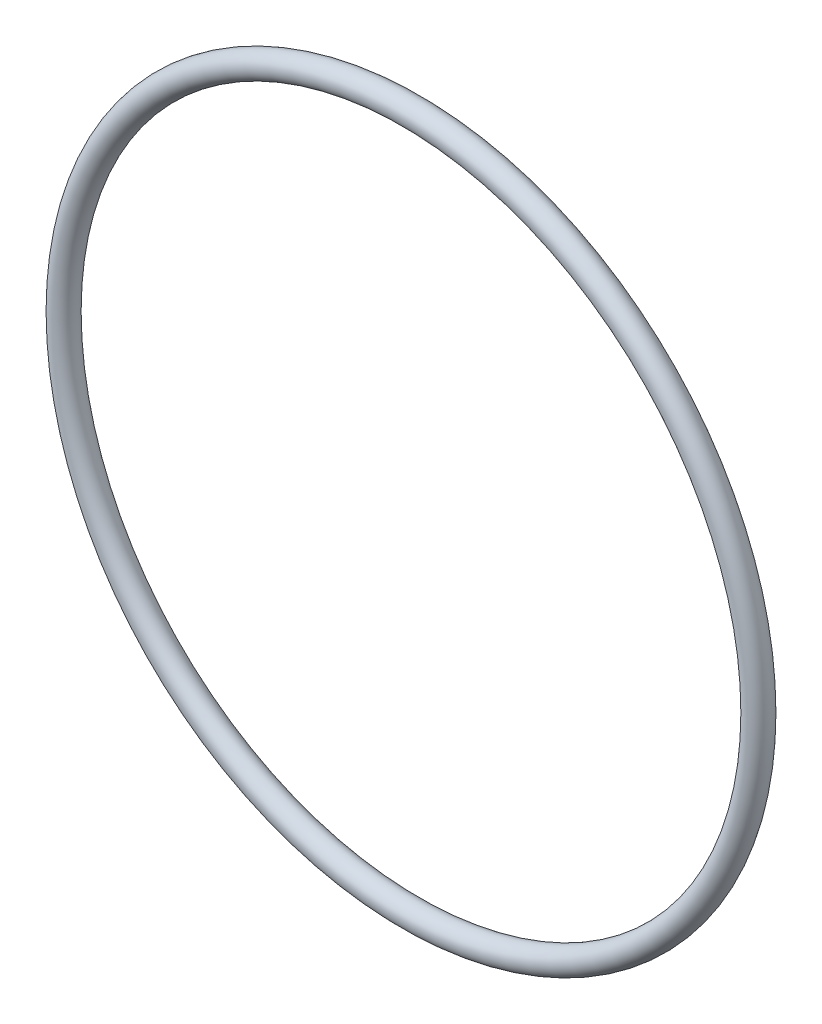
ISO-10303-21;
HEADER;
FILE_DESCRIPTION(('STEP AP214'),'2;1');
FILE_NAME('part.step','',(''),(''),'','','');
FILE_SCHEMA(('AUTOMOTIVE_DESIGN { 1 0 10303 214 1 1 1 1 }'));
ENDSEC;
DATA;
#1=APPLICATION_CONTEXT('core data for automotive mechanical design processes');
#2=APPLICATION_PROTOCOL_DEFINITION('international standard','automotive_design',2000,#1);
#3=PRODUCT_CONTEXT('',#1,'mechanical');
#4=PRODUCT('Part','Part','',(#3));
#5=PRODUCT_RELATED_PRODUCT_CATEGORY('part','',(#4));
#6=PRODUCT_DEFINITION_FORMATION('','',#4);
#7=PRODUCT_DEFINITION_CONTEXT('part definition',#1,'design');
#8=PRODUCT_DEFINITION('design','',#6,#7);
#9=PRODUCT_DEFINITION_SHAPE('','',#8);
#10=(LENGTH_UNIT() NAMED_UNIT(*) SI_UNIT(.MILLI.,.METRE.));
#11=(NAMED_UNIT(*) PLANE_ANGLE_UNIT() SI_UNIT($,.RADIAN.));
#12=(NAMED_UNIT(*) SI_UNIT($,.STERADIAN.) SOLID_ANGLE_UNIT());
#13=UNCERTAINTY_MEASURE_WITH_UNIT(LENGTH_MEASURE(1.E-05),#10,'distance_accuracy_value','');
#14=(GEOMETRIC_REPRESENTATION_CONTEXT(3) GLOBAL_UNCERTAINTY_ASSIGNED_CONTEXT((#13)) GLOBAL_UNIT_ASSIGNED_CONTEXT((#10,
#11,#12)) REPRESENTATION_CONTEXT('',''));
#15=CARTESIAN_POINT('',(0.,0.,0.));
#16=DIRECTION('',(0.,0.,1.));
#17=DIRECTION('',(1.,0.,0.));
#18=AXIS2_PLACEMENT_3D('',#15,#16,#17);
#19=CARTESIAN_POINT('',(0.,0.,1.8));
#20=DIRECTION('',(0.,0.,-1.));
#21=DIRECTION('',(-1.,0.,0.));
#22=AXIS2_PLACEMENT_3D('',#19,#20,#21);
#23=TOROIDAL_SURFACE('',#22,1.4,0.0499999999999999);
#24=CARTESIAN_POINT('',(-1.45,0.,1.8));
#25=VERTEX_POINT('',#24);
#26=VERTEX_LOOP('',#25);
#27=FACE_BOUND('',#26,.T.);
#28=ADVANCED_FACE('F13',(#27),#23,.T.);
#29=CLOSED_SHELL('',(#28));
#30=MANIFOLD_SOLID_BREP('B1',#29);
#31=ADVANCED_BREP_SHAPE_REPRESENTATION('',(#18,#30),#14);
#32=SHAPE_DEFINITION_REPRESENTATION(#9,#31);
ENDSEC;
END-ISO-10303-21;
